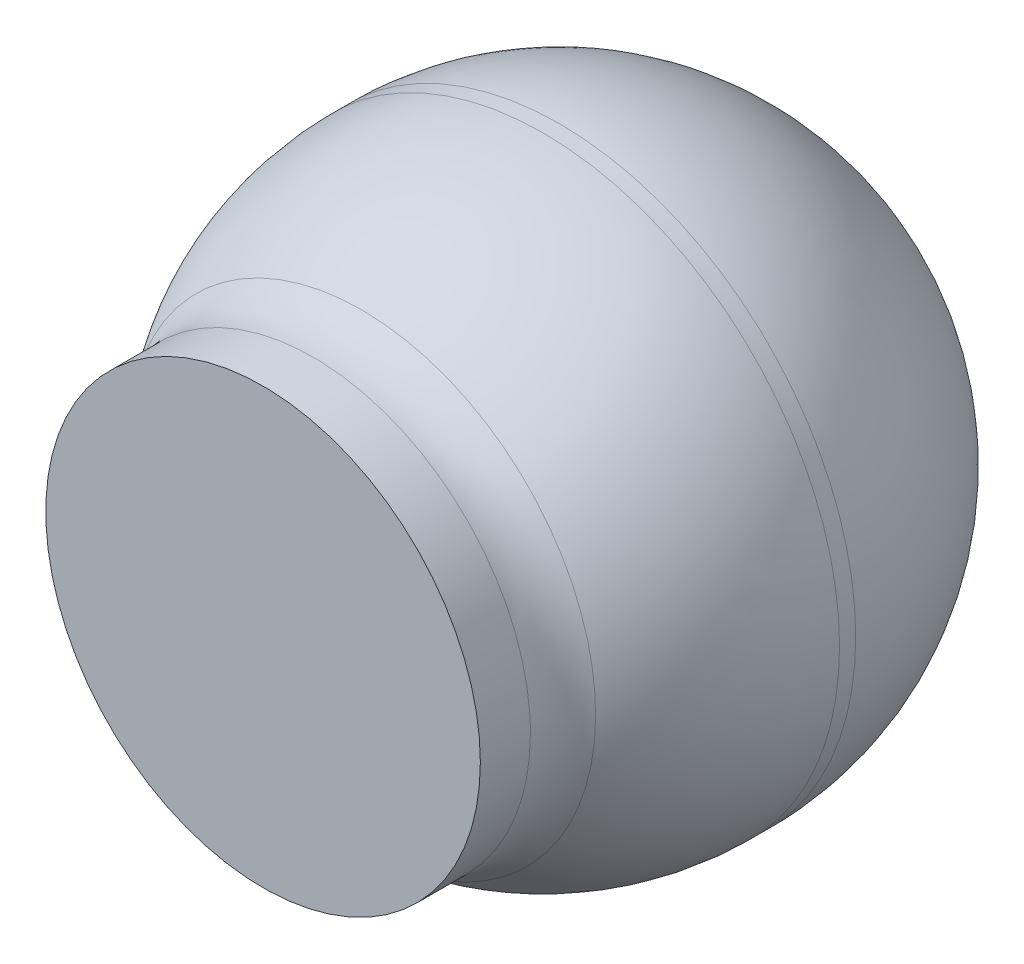
ISO-10303-21;
HEADER;
FILE_DESCRIPTION(('STEP AP214'),'2;1');
FILE_NAME('part.step','',(''),(''),'','','');
FILE_SCHEMA(('AUTOMOTIVE_DESIGN { 1 0 10303 214 1 1 1 1 }'));
ENDSEC;
DATA;
#1=APPLICATION_CONTEXT('core data for automotive mechanical design processes');
#2=APPLICATION_PROTOCOL_DEFINITION('international standard','automotive_design',2000,#1);
#3=PRODUCT_CONTEXT('',#1,'mechanical');
#4=PRODUCT('Part','Part','',(#3));
#5=PRODUCT_RELATED_PRODUCT_CATEGORY('part','',(#4));
#6=PRODUCT_DEFINITION_FORMATION('','',#4);
#7=PRODUCT_DEFINITION_CONTEXT('part definition',#1,'design');
#8=PRODUCT_DEFINITION('design','',#6,#7);
#9=PRODUCT_DEFINITION_SHAPE('','',#8);
#10=(LENGTH_UNIT() NAMED_UNIT(*) SI_UNIT(.MILLI.,.METRE.));
#11=(NAMED_UNIT(*) PLANE_ANGLE_UNIT() SI_UNIT($,.RADIAN.));
#12=(NAMED_UNIT(*) SI_UNIT($,.STERADIAN.) SOLID_ANGLE_UNIT());
#13=UNCERTAINTY_MEASURE_WITH_UNIT(LENGTH_MEASURE(1.E-05),#10,'distance_accuracy_value','');
#14=(GEOMETRIC_REPRESENTATION_CONTEXT(3) GLOBAL_UNCERTAINTY_ASSIGNED_CONTEXT((#13)) GLOBAL_UNIT_ASSIGNED_CONTEXT((#10,
#11,#12)) REPRESENTATION_CONTEXT('',''));
#15=CARTESIAN_POINT('',(0.,0.,0.));
#16=DIRECTION('',(0.,0.,1.));
#17=DIRECTION('',(1.,0.,0.));
#18=AXIS2_PLACEMENT_3D('',#15,#16,#17);
#19=CARTESIAN_POINT('',(0.707080077731,-7.861349291452,10.006534503384));
#20=DIRECTION('',(0.,0.,-1.));
#21=DIRECTION('',(-1.,0.,0.));
#22=AXIS2_PLACEMENT_3D('',#19,#20,#21);
#23=PLANE('',#22);
#24=CARTESIAN_POINT('',(0.707080077731,-7.861349291452,10.006534503384));
#25=DIRECTION('',(0.,0.,1.));
#26=DIRECTION('',(1.,0.,0.));
#27=AXIS2_PLACEMENT_3D('',#24,#25,#26);
#28=CIRCLE('',#27,0.275);
#29=CARTESIAN_POINT('',(0.982080077731,-7.861349291452,10.006534503384));
#30=VERTEX_POINT('',#29);
#31=EDGE_CURVE('E20',#30,#30,#28,.F.);
#32=ORIENTED_EDGE('',*,*,#31,.F.);
#33=EDGE_LOOP('',(#32));
#34=FACE_BOUND('',#33,.T.);
#35=ADVANCED_FACE('F17',(#34),#23,.F.);
#36=CARTESIAN_POINT('',(0.707080077731,-7.861349291452,9.906534503384));
#37=DIRECTION('',(0.,0.,1.));
#38=DIRECTION('',(1.,0.,0.));
#39=AXIS2_PLACEMENT_3D('',#36,#37,#38);
#40=CYLINDRICAL_SURFACE('',#39,0.275);
#41=CARTESIAN_POINT('',(0.707080077731,-7.861349291452,9.943180457728));
#42=DIRECTION('',(0.,0.,-1.));
#43=DIRECTION('',(0.996700902337582,0.081162252799247,0.));
#44=AXIS2_PLACEMENT_3D('',#41,#42,#43);
#45=CIRCLE('',#44,0.275);
#46=CARTESIAN_POINT('',(0.981172825873835,-7.83902967193221,9.943180457728));
#47=VERTEX_POINT('',#46);
#48=EDGE_CURVE('E65',#47,#47,#45,.F.);
#49=ORIENTED_EDGE('',*,*,#48,.T.);
#50=EDGE_LOOP('',(#49));
#51=FACE_BOUND('',#50,.T.);
#52=ORIENTED_EDGE('',*,*,#31,.T.);
#53=EDGE_LOOP('',(#52));
#54=FACE_BOUND('',#53,.T.);
#55=ADVANCED_FACE('F62',(#51,#54),#40,.T.);
#56=CARTESIAN_POINT('',(0.707080077731,-7.861349291452,9.943180457728));
#57=DIRECTION('',(0.,0.,-1.));
#58=DIRECTION('',(0.996700902337583,0.0811622527992449,0.));
#59=AXIS2_PLACEMENT_3D('',#56,#57,#58);
#60=TOROIDAL_SURFACE('',#59,0.375,0.1);
#61=ORIENTED_EDGE('',*,*,#48,.F.);
#62=EDGE_LOOP('',(#61));
#63=FACE_BOUND('',#62,.T.);
#64=CARTESIAN_POINT('',(0.707080077731001,-7.861349291452,9.881744931236));
#65=DIRECTION('',(0.,0.,-1.));
#66=DIRECTION('',(-0.996700902337598,-0.0811622527990622,0.));
#67=AXIS2_PLACEMENT_3D('',#64,#65,#66);
#68=CIRCLE('',#67,0.296097046412665);
#69=CARTESIAN_POINT('',(0.411959884392,-7.885381194786,9.881744931236));
#70=VERTEX_POINT('',#69);
#71=EDGE_CURVE('E39',#70,#70,#68,.T.);
#72=ORIENTED_EDGE('',*,*,#71,.F.);
#73=EDGE_LOOP('',(#72));
#74=FACE_BOUND('',#73,.T.);
#75=ADVANCED_FACE('F57',(#63,#74),#60,.F.);
#76=CARTESIAN_POINT('',(0.333317239355,-7.891785136252,9.651976062157));
#77=CARTESIAN_POINT('',(0.333317239355,-7.891785136252,9.701461392103));
#78=CARTESIAN_POINT('',(0.341473782652,-7.891120941579,9.750947004335));
#79=CARTESIAN_POINT('',(0.357792914651,-7.889792059952,9.798626332798));
#80=CARTESIAN_POINT('',(0.381658609162,-7.887848654938,9.842699544317));
#81=CARTESIAN_POINT('',(0.411959884392,-7.885381194786,9.881744931236));
#82=(BOUNDED_CURVE() B_SPLINE_CURVE(5,(#76,#77,#78,#79,#80,#81),.UNSPECIFIED.,.F.,
.F.) B_SPLINE_CURVE_WITH_KNOTS((6,6),(0.,0.661568582165),
.UNSPECIFIED.) CURVE() GEOMETRIC_REPRESENTATION_ITEM() RATIONAL_B_SPLINE_CURVE((1.,1.,1.,1.,1.,1.)) REPRESENTATION_ITEM(''));
#83=CARTESIAN_POINT('',(0.707080077731,-7.861349291452,9.651976062157));
#84=DIRECTION('',(0.,0.,-1.));
#85=AXIS1_PLACEMENT('',#83,#84);
#86=SURFACE_OF_REVOLUTION('',#82,#85);
#87=CARTESIAN_POINT('',(0.707080077731001,-7.861349291452,9.651976062157));
#88=DIRECTION('',(0.,0.,1.));
#89=DIRECTION('',(1.,0.,0.));
#90=AXIS2_PLACEMENT_3D('',#87,#88,#89);
#91=CIRCLE('',#90,0.375);
#92=CARTESIAN_POINT('',(1.082080077731,-7.861349291452,9.651976062157));
#93=VERTEX_POINT('',#92);
#94=EDGE_CURVE('E36',#93,#93,#91,.F.);
#95=ORIENTED_EDGE('',*,*,#94,.F.);
#96=EDGE_LOOP('',(#95));
#97=FACE_BOUND('',#96,.T.);
#98=ORIENTED_EDGE('',*,*,#71,.T.);
#99=EDGE_LOOP('',(#98));
#100=FACE_BOUND('',#99,.T.);
#101=ADVANCED_FACE('F53',(#97,#100),#86,.F.);
#102=CARTESIAN_POINT('',(0.707080077731,-7.861349291452,9.256534503384));
#103=DIRECTION('',(0.,0.,1.));
#104=DIRECTION('',(1.,0.,0.));
#105=AXIS2_PLACEMENT_3D('',#102,#103,#104);
#106=CYLINDRICAL_SURFACE('',#105,0.375);
#107=CARTESIAN_POINT('',(0.707080077731,-7.861349291452,9.631534503384));
#108=DIRECTION('',(0.,0.,-1.));
#109=DIRECTION('',(0.0811622527992362,-0.996700902337583,0.));
#110=AXIS2_PLACEMENT_3D('',#107,#108,#109);
#111=CIRCLE('',#110,0.375);
#112=CARTESIAN_POINT('',(0.737515922530713,-8.23511212982859,9.631534503384));
#113=VERTEX_POINT('',#112);
#114=CARTESIAN_POINT('',(0.676644232931287,-7.48758645307541,9.631534503384));
#115=VERTEX_POINT('',#114);
#116=EDGE_CURVE('E11',#113,#115,#111,.T.);
#117=ORIENTED_EDGE('',*,*,#116,.F.);
#118=CARTESIAN_POINT('',(0.707080077731,-7.861349291452,9.631534503384));
#119=DIRECTION('',(0.,0.,1.));
#120=DIRECTION('',(0.0811622527992359,-0.996700902337583,0.));
#121=AXIS2_PLACEMENT_3D('',#118,#119,#120);
#122=CIRCLE('',#121,0.375);
#123=EDGE_CURVE('E25',#115,#113,#122,.F.);
#124=ORIENTED_EDGE('',*,*,#123,.F.);
#125=EDGE_LOOP('',(#117,#124));
#126=FACE_BOUND('',#125,.T.);
#127=ORIENTED_EDGE('',*,*,#94,.T.);
#128=EDGE_LOOP('',(#127));
#129=FACE_BOUND('',#128,.T.);
#130=ADVANCED_FACE('F34',(#126,#129),#106,.T.);
#131=CARTESIAN_POINT('',(0.707080077731,-7.861349291452,9.631534503384));
#132=DIRECTION('',(0.0811622527992361,-0.996700902337583,0.));
#133=DIRECTION('',(-0.996700902337583,-0.0811622527992361,0.));
#134=AXIS2_PLACEMENT_3D('',#131,#132,#133);
#135=SPHERICAL_SURFACE('',#134,0.375);
#136=ORIENTED_EDGE('',*,*,#123,.T.);
#137=ORIENTED_EDGE('',*,*,#116,.T.);
#138=EDGE_LOOP('',(#136,#137));
#139=FACE_BOUND('',#138,.T.);
#140=ADVANCED_FACE('F32',(#139),#135,.T.);
#141=CLOSED_SHELL('',(#35,#55,#75,#101,#130,#140));
#142=MANIFOLD_SOLID_BREP('B1',#141);
#143=ADVANCED_BREP_SHAPE_REPRESENTATION('',(#18,#142),#14);
#144=SHAPE_DEFINITION_REPRESENTATION(#9,#143);
ENDSEC;
END-ISO-10303-21;
